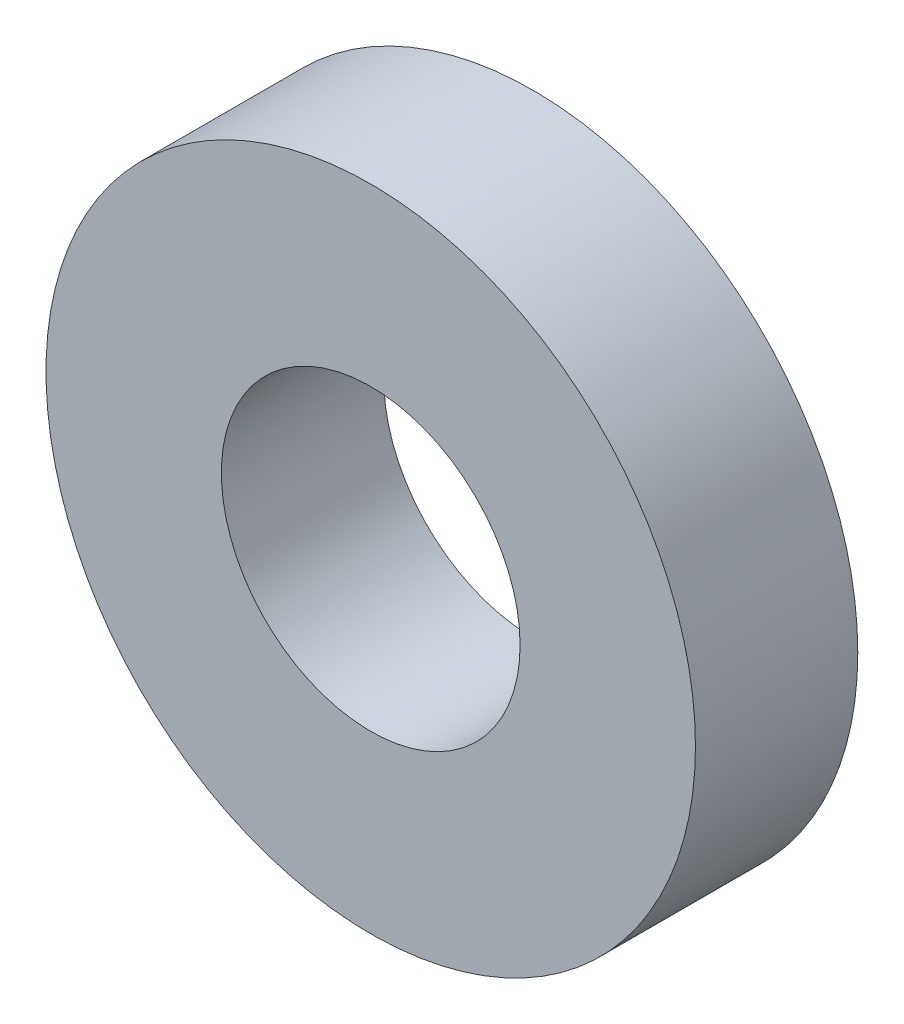
ISO-10303-21;
HEADER;
FILE_DESCRIPTION(('STEP AP214'),'2;1');
FILE_NAME('part.step','',(''),(''),'','','');
FILE_SCHEMA(('AUTOMOTIVE_DESIGN { 1 0 10303 214 1 1 1 1 }'));
ENDSEC;
DATA;
#1=APPLICATION_CONTEXT('core data for automotive mechanical design processes');
#2=APPLICATION_PROTOCOL_DEFINITION('international standard','automotive_design',2000,#1);
#3=PRODUCT_CONTEXT('',#1,'mechanical');
#4=PRODUCT('Part','Part','',(#3));
#5=PRODUCT_RELATED_PRODUCT_CATEGORY('part','',(#4));
#6=PRODUCT_DEFINITION_FORMATION('','',#4);
#7=PRODUCT_DEFINITION_CONTEXT('part definition',#1,'design');
#8=PRODUCT_DEFINITION('design','',#6,#7);
#9=PRODUCT_DEFINITION_SHAPE('','',#8);
#10=(LENGTH_UNIT() NAMED_UNIT(*) SI_UNIT(.MILLI.,.METRE.));
#11=(NAMED_UNIT(*) PLANE_ANGLE_UNIT() SI_UNIT($,.RADIAN.));
#12=(NAMED_UNIT(*) SI_UNIT($,.STERADIAN.) SOLID_ANGLE_UNIT());
#13=UNCERTAINTY_MEASURE_WITH_UNIT(LENGTH_MEASURE(1.E-05),#10,'distance_accuracy_value','');
#14=(GEOMETRIC_REPRESENTATION_CONTEXT(3) GLOBAL_UNCERTAINTY_ASSIGNED_CONTEXT((#13)) GLOBAL_UNIT_ASSIGNED_CONTEXT((#10,
#11,#12)) REPRESENTATION_CONTEXT('',''));
#15=CARTESIAN_POINT('',(0.,0.,0.));
#16=DIRECTION('',(0.,0.,1.));
#17=DIRECTION('',(1.,0.,0.));
#18=AXIS2_PLACEMENT_3D('',#15,#16,#17);
#19=CARTESIAN_POINT('',(0.,0.,0.79375));
#20=DIRECTION('',(0.,0.,1.));
#21=DIRECTION('',(1.,0.,0.));
#22=AXIS2_PLACEMENT_3D('',#19,#20,#21);
#23=PLANE('',#22);
#24=CARTESIAN_POINT('',(0.,0.,0.79375));
#25=DIRECTION('',(0.,0.,1.));
#26=DIRECTION('',(1.,0.,0.));
#27=AXIS2_PLACEMENT_3D('',#24,#25,#26);
#28=CIRCLE('',#27,3.175);
#29=CARTESIAN_POINT('',(3.175,0.,0.79375));
#30=VERTEX_POINT('',#29);
#31=EDGE_CURVE('E10',#30,#30,#28,.T.);
#32=ORIENTED_EDGE('',*,*,#31,.T.);
#33=EDGE_LOOP('',(#32));
#34=FACE_BOUND('',#33,.T.);
#35=CARTESIAN_POINT('',(0.,0.,0.79375));
#36=DIRECTION('',(0.,0.,1.));
#37=DIRECTION('',(1.,0.,0.));
#38=AXIS2_PLACEMENT_3D('',#35,#36,#37);
#39=CIRCLE('',#38,1.4605);
#40=CARTESIAN_POINT('',(1.4605,0.,0.79375));
#41=VERTEX_POINT('',#40);
#42=EDGE_CURVE('E41',#41,#41,#39,.T.);
#43=ORIENTED_EDGE('',*,*,#42,.F.);
#44=EDGE_LOOP('',(#43));
#45=FACE_BOUND('',#44,.T.);
#46=ADVANCED_FACE('F30',(#34,#45),#23,.T.);
#47=CARTESIAN_POINT('',(0.,0.,-0.79375));
#48=DIRECTION('',(0.,0.,1.));
#49=DIRECTION('',(1.,0.,0.));
#50=AXIS2_PLACEMENT_3D('',#47,#48,#49);
#51=PLANE('',#50);
#52=CARTESIAN_POINT('',(0.,0.,-0.79375));
#53=DIRECTION('',(0.,0.,1.));
#54=DIRECTION('',(1.,0.,0.));
#55=AXIS2_PLACEMENT_3D('',#52,#53,#54);
#56=CIRCLE('',#55,3.175);
#57=CARTESIAN_POINT('',(3.175,0.,-0.79375));
#58=VERTEX_POINT('',#57);
#59=EDGE_CURVE('E34',#58,#58,#56,.T.);
#60=ORIENTED_EDGE('',*,*,#59,.F.);
#61=EDGE_LOOP('',(#60));
#62=FACE_BOUND('',#61,.T.);
#63=CARTESIAN_POINT('',(0.,0.,-0.79375));
#64=DIRECTION('',(0.,0.,1.));
#65=DIRECTION('',(1.,0.,0.));
#66=AXIS2_PLACEMENT_3D('',#63,#64,#65);
#67=CIRCLE('',#66,1.4605);
#68=CARTESIAN_POINT('',(1.4605,0.,-0.79375));
#69=VERTEX_POINT('',#68);
#70=EDGE_CURVE('E43',#69,#69,#67,.T.);
#71=ORIENTED_EDGE('',*,*,#70,.T.);
#72=EDGE_LOOP('',(#71));
#73=FACE_BOUND('',#72,.T.);
#74=ADVANCED_FACE('F53',(#62,#73),#51,.F.);
#75=CARTESIAN_POINT('',(0.,0.,0.79375));
#76=DIRECTION('',(0.,0.,-1.));
#77=DIRECTION('',(-1.,0.,0.));
#78=AXIS2_PLACEMENT_3D('',#75,#76,#77);
#79=CYLINDRICAL_SURFACE('',#78,3.175);
#80=ORIENTED_EDGE('',*,*,#31,.F.);
#81=EDGE_LOOP('',(#80));
#82=FACE_BOUND('',#81,.T.);
#83=ORIENTED_EDGE('',*,*,#59,.T.);
#84=EDGE_LOOP('',(#83));
#85=FACE_BOUND('',#84,.T.);
#86=ADVANCED_FACE('F32',(#82,#85),#79,.T.);
#87=CARTESIAN_POINT('',(0.,0.,0.79375));
#88=DIRECTION('',(0.,0.,-1.));
#89=DIRECTION('',(-1.,0.,0.));
#90=AXIS2_PLACEMENT_3D('',#87,#88,#89);
#91=CYLINDRICAL_SURFACE('',#90,1.4605);
#92=ORIENTED_EDGE('',*,*,#42,.T.);
#93=EDGE_LOOP('',(#92));
#94=FACE_BOUND('',#93,.T.);
#95=ORIENTED_EDGE('',*,*,#70,.F.);
#96=EDGE_LOOP('',(#95));
#97=FACE_BOUND('',#96,.T.);
#98=ADVANCED_FACE('F49',(#94,#97),#91,.F.);
#99=CLOSED_SHELL('',(#46,#74,#86,#98));
#100=MANIFOLD_SOLID_BREP('B2',#99);
#101=ADVANCED_BREP_SHAPE_REPRESENTATION('',(#18,#100),#14);
#102=SHAPE_DEFINITION_REPRESENTATION(#9,#101);
ENDSEC;
END-ISO-10303-21;
